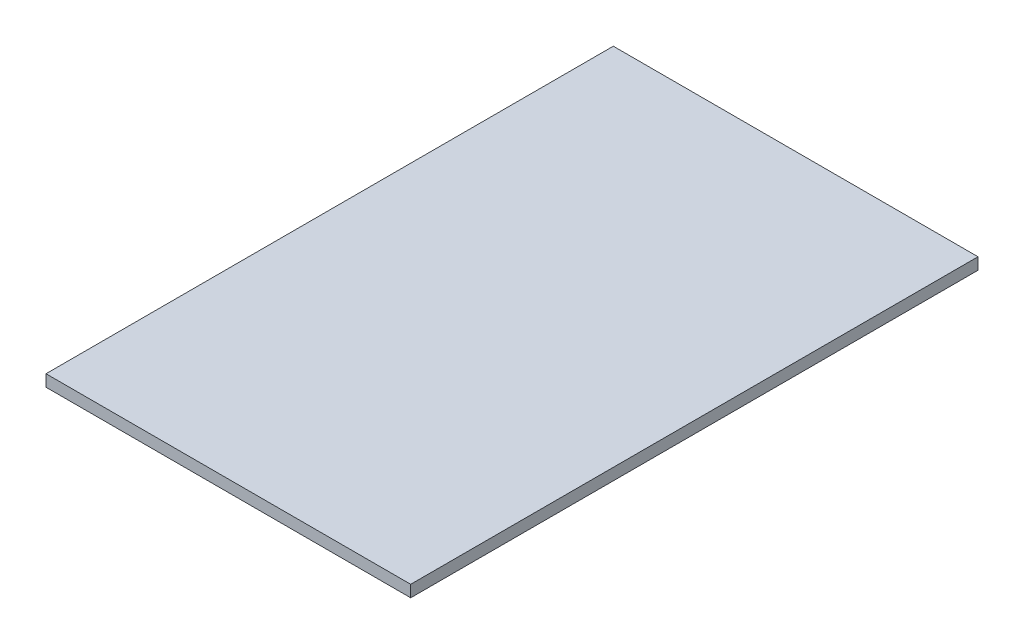
ISO-10303-21;
HEADER;
FILE_DESCRIPTION(('STEP AP214'),'2;1');
FILE_NAME('part.step','',(''),(''),'','','');
FILE_SCHEMA(('AUTOMOTIVE_DESIGN { 1 0 10303 214 1 1 1 1 }'));
ENDSEC;
DATA;
#1=APPLICATION_CONTEXT('core data for automotive mechanical design processes');
#2=APPLICATION_PROTOCOL_DEFINITION('international standard','automotive_design',2000,#1);
#3=PRODUCT_CONTEXT('',#1,'mechanical');
#4=PRODUCT('Part','Part','',(#3));
#5=PRODUCT_RELATED_PRODUCT_CATEGORY('part','',(#4));
#6=PRODUCT_DEFINITION_FORMATION('','',#4);
#7=PRODUCT_DEFINITION_CONTEXT('part definition',#1,'design');
#8=PRODUCT_DEFINITION('design','',#6,#7);
#9=PRODUCT_DEFINITION_SHAPE('','',#8);
#10=(LENGTH_UNIT() NAMED_UNIT(*) SI_UNIT(.MILLI.,.METRE.));
#11=(NAMED_UNIT(*) PLANE_ANGLE_UNIT() SI_UNIT($,.RADIAN.));
#12=(NAMED_UNIT(*) SI_UNIT($,.STERADIAN.) SOLID_ANGLE_UNIT());
#13=UNCERTAINTY_MEASURE_WITH_UNIT(LENGTH_MEASURE(1.E-05),#10,'distance_accuracy_value','');
#14=(GEOMETRIC_REPRESENTATION_CONTEXT(3) GLOBAL_UNCERTAINTY_ASSIGNED_CONTEXT((#13)) GLOBAL_UNIT_ASSIGNED_CONTEXT((#10,
#11,#12)) REPRESENTATION_CONTEXT('',''));
#15=CARTESIAN_POINT('',(0.,0.,0.));
#16=DIRECTION('',(0.,0.,1.));
#17=DIRECTION('',(1.,0.,0.));
#18=AXIS2_PLACEMENT_3D('',#15,#16,#17);
#19=CARTESIAN_POINT('',(0.,1.59,0.));
#20=DIRECTION('',(1.,0.,0.));
#21=DIRECTION('',(0.,0.,-1.));
#22=AXIS2_PLACEMENT_3D('',#19,#20,#21);
#23=PLANE('',#22);
#24=DIRECTION('',(0.,0.,1.));
#25=VECTOR('',#24,1.);
#26=CARTESIAN_POINT('',(0.,0.,0.));
#27=LINE('',#26,#25);
#28=CARTESIAN_POINT('',(0.,0.,-77.));
#29=VERTEX_POINT('',#28);
#30=CARTESIAN_POINT('',(0.,0.,0.));
#31=VERTEX_POINT('',#30);
#32=EDGE_CURVE('E111',#29,#31,#27,.T.);
#33=ORIENTED_EDGE('',*,*,#32,.T.);
#34=DIRECTION('',(0.,-1.,0.));
#35=VECTOR('',#34,1.);
#36=CARTESIAN_POINT('',(0.,1.59,0.));
#37=LINE('',#36,#35);
#38=CARTESIAN_POINT('',(0.,1.59,0.));
#39=VERTEX_POINT('',#38);
#40=EDGE_CURVE('E11',#39,#31,#37,.T.);
#41=ORIENTED_EDGE('',*,*,#40,.F.);
#42=DIRECTION('',(0.,0.,1.));
#43=VECTOR('',#42,1.);
#44=CARTESIAN_POINT('',(0.,1.59,0.));
#45=LINE('',#44,#43);
#46=CARTESIAN_POINT('',(0.,1.59,-77.));
#47=VERTEX_POINT('',#46);
#48=EDGE_CURVE('E95',#47,#39,#45,.T.);
#49=ORIENTED_EDGE('',*,*,#48,.F.);
#50=DIRECTION('',(0.,-1.,0.));
#51=VECTOR('',#50,1.);
#52=CARTESIAN_POINT('',(0.,1.59,-77.));
#53=LINE('',#52,#51);
#54=EDGE_CURVE('E107',#47,#29,#53,.T.);
#55=ORIENTED_EDGE('',*,*,#54,.T.);
#56=EDGE_LOOP('',(#33,#41,#49,#55));
#57=FACE_BOUND('',#56,.T.);
#58=ADVANCED_FACE('F43',(#57),#23,.F.);
#59=CARTESIAN_POINT('',(0.,1.59,0.));
#60=DIRECTION('',(0.,0.,-1.));
#61=DIRECTION('',(-1.,0.,0.));
#62=AXIS2_PLACEMENT_3D('',#59,#60,#61);
#63=PLANE('',#62);
#64=DIRECTION('',(1.,0.,0.));
#65=VECTOR('',#64,1.);
#66=CARTESIAN_POINT('',(0.,0.,0.));
#67=LINE('',#66,#65);
#68=CARTESIAN_POINT('',(49.5,0.,0.));
#69=VERTEX_POINT('',#68);
#70=EDGE_CURVE('E100',#31,#69,#67,.T.);
#71=ORIENTED_EDGE('',*,*,#70,.T.);
#72=DIRECTION('',(0.,-1.,0.));
#73=VECTOR('',#72,1.);
#74=CARTESIAN_POINT('',(49.5,1.59,0.));
#75=LINE('',#74,#73);
#76=CARTESIAN_POINT('',(49.5,1.59,0.));
#77=VERTEX_POINT('',#76);
#78=EDGE_CURVE('E52',#77,#69,#75,.T.);
#79=ORIENTED_EDGE('',*,*,#78,.F.);
#80=DIRECTION('',(1.,0.,0.));
#81=VECTOR('',#80,1.);
#82=CARTESIAN_POINT('',(0.,1.59,0.));
#83=LINE('',#82,#81);
#84=EDGE_CURVE('E90',#39,#77,#83,.T.);
#85=ORIENTED_EDGE('',*,*,#84,.F.);
#86=ORIENTED_EDGE('',*,*,#40,.T.);
#87=EDGE_LOOP('',(#71,#79,#85,#86));
#88=FACE_BOUND('',#87,.T.);
#89=ADVANCED_FACE('F99',(#88),#63,.F.);
#90=CARTESIAN_POINT('',(49.5,1.59,0.));
#91=DIRECTION('',(-1.,0.,0.));
#92=DIRECTION('',(0.,0.,1.));
#93=AXIS2_PLACEMENT_3D('',#90,#91,#92);
#94=PLANE('',#93);
#95=DIRECTION('',(0.,0.,-1.));
#96=VECTOR('',#95,1.);
#97=CARTESIAN_POINT('',(49.5,0.,0.));
#98=LINE('',#97,#96);
#99=CARTESIAN_POINT('',(49.5,0.,-77.));
#100=VERTEX_POINT('',#99);
#101=EDGE_CURVE('E77',#69,#100,#98,.T.);
#102=ORIENTED_EDGE('',*,*,#101,.T.);
#103=DIRECTION('',(0.,-1.,0.));
#104=VECTOR('',#103,1.);
#105=CARTESIAN_POINT('',(49.5,1.59,-77.));
#106=LINE('',#105,#104);
#107=CARTESIAN_POINT('',(49.5,1.59,-77.));
#108=VERTEX_POINT('',#107);
#109=EDGE_CURVE('E102',#108,#100,#106,.T.);
#110=ORIENTED_EDGE('',*,*,#109,.F.);
#111=DIRECTION('',(0.,0.,-1.));
#112=VECTOR('',#111,1.);
#113=CARTESIAN_POINT('',(49.5,1.59,0.));
#114=LINE('',#113,#112);
#115=EDGE_CURVE('E93',#77,#108,#114,.T.);
#116=ORIENTED_EDGE('',*,*,#115,.F.);
#117=ORIENTED_EDGE('',*,*,#78,.T.);
#118=EDGE_LOOP('',(#102,#110,#116,#117));
#119=FACE_BOUND('',#118,.T.);
#120=ADVANCED_FACE('F103',(#119),#94,.F.);
#121=CARTESIAN_POINT('',(0.,1.59,-77.));
#122=DIRECTION('',(0.,0.,1.));
#123=DIRECTION('',(1.,0.,0.));
#124=AXIS2_PLACEMENT_3D('',#121,#122,#123);
#125=PLANE('',#124);
#126=DIRECTION('',(-1.,0.,0.));
#127=VECTOR('',#126,1.);
#128=CARTESIAN_POINT('',(0.,0.,-77.));
#129=LINE('',#128,#127);
#130=EDGE_CURVE('E83',#100,#29,#129,.T.);
#131=ORIENTED_EDGE('',*,*,#130,.T.);
#132=ORIENTED_EDGE('',*,*,#54,.F.);
#133=DIRECTION('',(-1.,0.,0.));
#134=VECTOR('',#133,1.);
#135=CARTESIAN_POINT('',(0.,1.59,-77.));
#136=LINE('',#135,#134);
#137=EDGE_CURVE('E60',#108,#47,#136,.T.);
#138=ORIENTED_EDGE('',*,*,#137,.F.);
#139=ORIENTED_EDGE('',*,*,#109,.T.);
#140=EDGE_LOOP('',(#131,#132,#138,#139));
#141=FACE_BOUND('',#140,.T.);
#142=ADVANCED_FACE('F124',(#141),#125,.F.);
#143=CARTESIAN_POINT('',(0.,1.59,0.));
#144=DIRECTION('',(0.,-1.,0.));
#145=DIRECTION('',(0.,0.,-1.));
#146=AXIS2_PLACEMENT_3D('',#143,#144,#145);
#147=PLANE('',#146);
#148=ORIENTED_EDGE('',*,*,#48,.T.);
#149=ORIENTED_EDGE('',*,*,#84,.T.);
#150=ORIENTED_EDGE('',*,*,#115,.T.);
#151=ORIENTED_EDGE('',*,*,#137,.T.);
#152=EDGE_LOOP('',(#148,#149,#150,#151));
#153=FACE_BOUND('',#152,.T.);
#154=ADVANCED_FACE('F91',(#153),#147,.F.);
#155=CARTESIAN_POINT('',(0.,0.,0.));
#156=DIRECTION('',(0.,-1.,0.));
#157=DIRECTION('',(0.,0.,-1.));
#158=AXIS2_PLACEMENT_3D('',#155,#156,#157);
#159=PLANE('',#158);
#160=ORIENTED_EDGE('',*,*,#32,.F.);
#161=ORIENTED_EDGE('',*,*,#130,.F.);
#162=ORIENTED_EDGE('',*,*,#101,.F.);
#163=ORIENTED_EDGE('',*,*,#70,.F.);
#164=EDGE_LOOP('',(#160,#161,#162,#163));
#165=FACE_BOUND('',#164,.T.);
#166=ADVANCED_FACE('F127',(#165),#159,.T.);
#167=CLOSED_SHELL('',(#58,#89,#120,#142,#154,#166));
#168=MANIFOLD_SOLID_BREP('B2',#167);
#169=ADVANCED_BREP_SHAPE_REPRESENTATION('',(#18,#168),#14);
#170=SHAPE_DEFINITION_REPRESENTATION(#9,#169);
ENDSEC;
END-ISO-10303-21;
